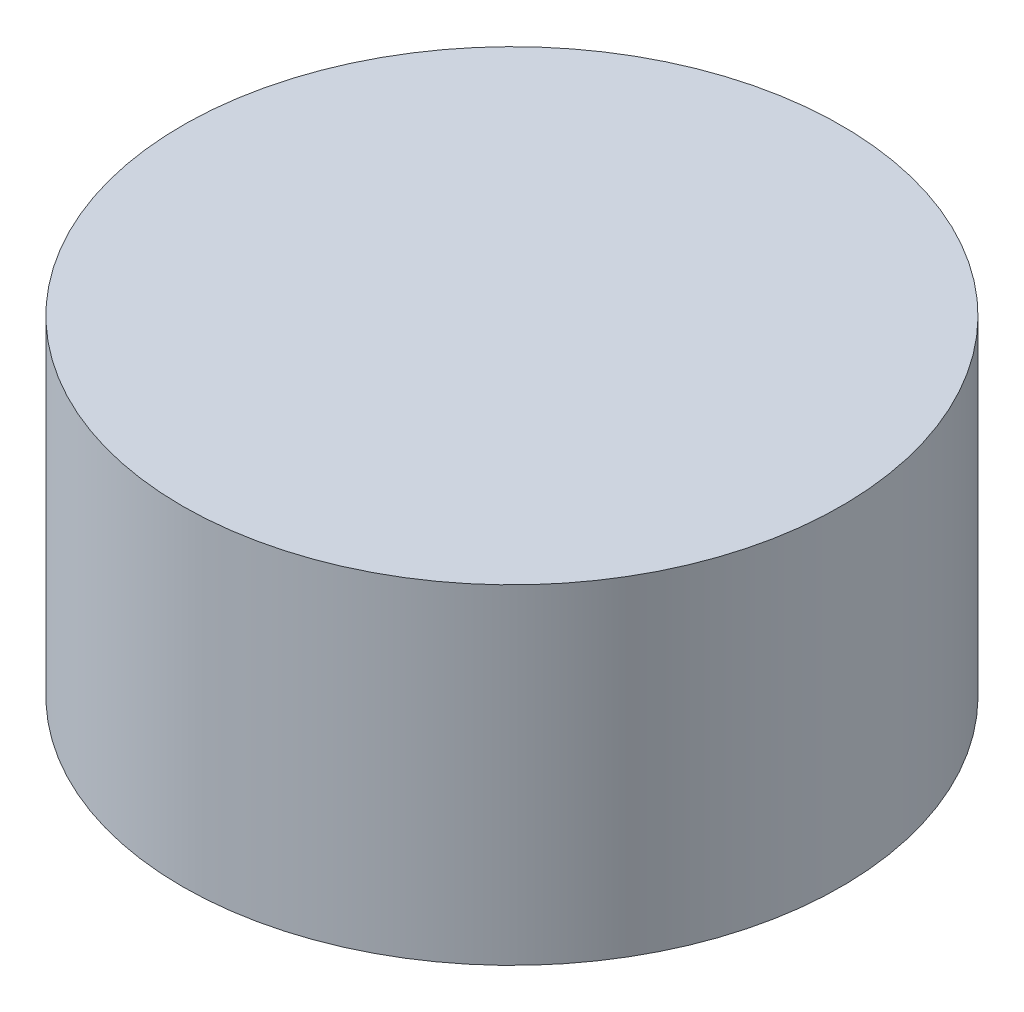
ISO-10303-21;
HEADER;
FILE_DESCRIPTION(('STEP AP214'),'2;1');
FILE_NAME('part.step','',(''),(''),'','','');
FILE_SCHEMA(('AUTOMOTIVE_DESIGN { 1 0 10303 214 1 1 1 1 }'));
ENDSEC;
DATA;
#1=APPLICATION_CONTEXT('core data for automotive mechanical design processes');
#2=APPLICATION_PROTOCOL_DEFINITION('international standard','automotive_design',2000,#1);
#3=PRODUCT_CONTEXT('',#1,'mechanical');
#4=PRODUCT('Part','Part','',(#3));
#5=PRODUCT_RELATED_PRODUCT_CATEGORY('part','',(#4));
#6=PRODUCT_DEFINITION_FORMATION('','',#4);
#7=PRODUCT_DEFINITION_CONTEXT('part definition',#1,'design');
#8=PRODUCT_DEFINITION('design','',#6,#7);
#9=PRODUCT_DEFINITION_SHAPE('','',#8);
#10=(LENGTH_UNIT() NAMED_UNIT(*) SI_UNIT(.MILLI.,.METRE.));
#11=(NAMED_UNIT(*) PLANE_ANGLE_UNIT() SI_UNIT($,.RADIAN.));
#12=(NAMED_UNIT(*) SI_UNIT($,.STERADIAN.) SOLID_ANGLE_UNIT());
#13=UNCERTAINTY_MEASURE_WITH_UNIT(LENGTH_MEASURE(1.E-05),#10,'distance_accuracy_value','');
#14=(GEOMETRIC_REPRESENTATION_CONTEXT(3) GLOBAL_UNCERTAINTY_ASSIGNED_CONTEXT((#13)) GLOBAL_UNIT_ASSIGNED_CONTEXT((#10,
#11,#12)) REPRESENTATION_CONTEXT('',''));
#15=CARTESIAN_POINT('',(0.,0.,0.));
#16=DIRECTION('',(0.,0.,1.));
#17=DIRECTION('',(1.,0.,0.));
#18=AXIS2_PLACEMENT_3D('',#15,#16,#17);
#19=CARTESIAN_POINT('',(0.,0.79375,0.));
#20=DIRECTION('',(0.,-1.,0.));
#21=DIRECTION('',(0.,0.,-1.));
#22=AXIS2_PLACEMENT_3D('',#19,#20,#21);
#23=CYLINDRICAL_SURFACE('',#22,0.79375);
#24=CARTESIAN_POINT('',(0.,0.79375,0.));
#25=DIRECTION('',(0.,1.,0.));
#26=DIRECTION('',(0.,0.,1.));
#27=AXIS2_PLACEMENT_3D('',#24,#25,#26);
#28=CIRCLE('',#27,0.79375);
#29=CARTESIAN_POINT('',(0.,0.79375,0.79375));
#30=VERTEX_POINT('',#29);
#31=EDGE_CURVE('E10',#30,#30,#28,.T.);
#32=ORIENTED_EDGE('',*,*,#31,.F.);
#33=EDGE_LOOP('',(#32));
#34=FACE_BOUND('',#33,.T.);
#35=CARTESIAN_POINT('',(0.,0.,0.));
#36=DIRECTION('',(0.,1.,0.));
#37=DIRECTION('',(0.,0.,1.));
#38=AXIS2_PLACEMENT_3D('',#35,#36,#37);
#39=CIRCLE('',#38,0.79375);
#40=CARTESIAN_POINT('',(0.,0.,0.79375));
#41=VERTEX_POINT('',#40);
#42=EDGE_CURVE('E35',#41,#41,#39,.T.);
#43=ORIENTED_EDGE('',*,*,#42,.T.);
#44=EDGE_LOOP('',(#43));
#45=FACE_BOUND('',#44,.T.);
#46=ADVANCED_FACE('F32',(#34,#45),#23,.T.);
#47=CARTESIAN_POINT('',(0.,0.79375,0.));
#48=DIRECTION('',(0.,1.,0.));
#49=DIRECTION('',(0.,0.,1.));
#50=AXIS2_PLACEMENT_3D('',#47,#48,#49);
#51=PLANE('',#50);
#52=ORIENTED_EDGE('',*,*,#31,.T.);
#53=EDGE_LOOP('',(#52));
#54=FACE_BOUND('',#53,.T.);
#55=ADVANCED_FACE('F47',(#54),#51,.T.);
#56=CARTESIAN_POINT('',(0.,0.,0.));
#57=DIRECTION('',(0.,1.,0.));
#58=DIRECTION('',(0.,0.,1.));
#59=AXIS2_PLACEMENT_3D('',#56,#57,#58);
#60=PLANE('',#59);
#61=ORIENTED_EDGE('',*,*,#42,.F.);
#62=EDGE_LOOP('',(#61));
#63=FACE_BOUND('',#62,.T.);
#64=ADVANCED_FACE('F45',(#63),#60,.F.);
#65=CLOSED_SHELL('',(#46,#55,#64));
#66=MANIFOLD_SOLID_BREP('B2',#65);
#67=ADVANCED_BREP_SHAPE_REPRESENTATION('',(#18,#66),#14);
#68=SHAPE_DEFINITION_REPRESENTATION(#9,#67);
ENDSEC;
END-ISO-10303-21;
